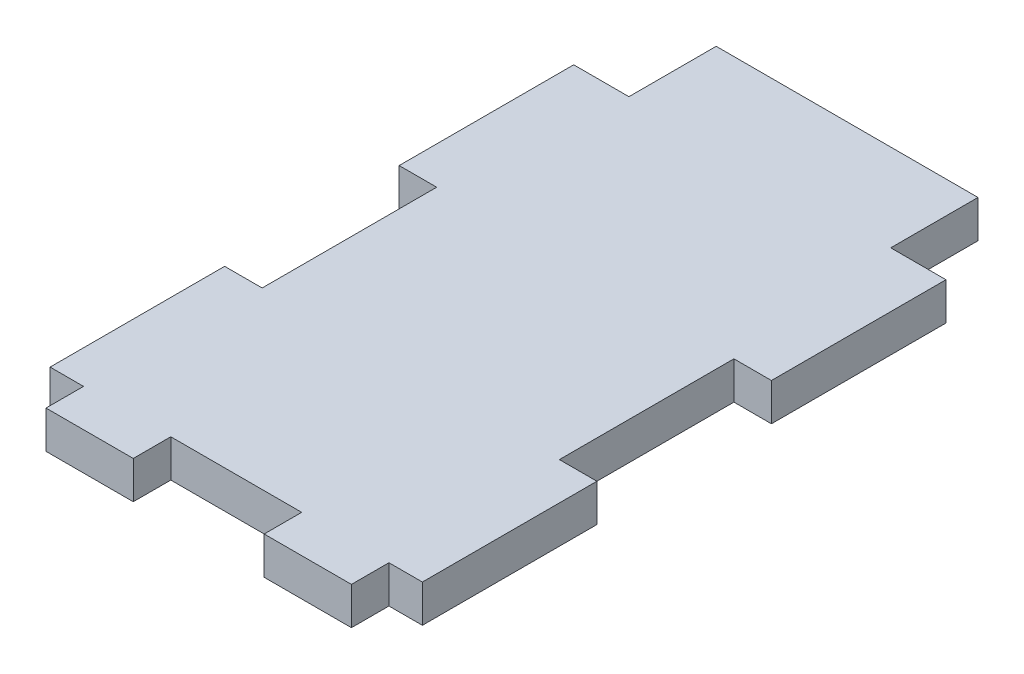
ISO-10303-21;
HEADER;
FILE_DESCRIPTION(('STEP AP214'),'2;1');
FILE_NAME('part.step','',(''),(''),'','','');
FILE_SCHEMA(('AUTOMOTIVE_DESIGN { 1 0 10303 214 1 1 1 1 }'));
ENDSEC;
DATA;
#1=APPLICATION_CONTEXT('core data for automotive mechanical design processes');
#2=APPLICATION_PROTOCOL_DEFINITION('international standard','automotive_design',2000,#1);
#3=PRODUCT_CONTEXT('',#1,'mechanical');
#4=PRODUCT('Part','Part','',(#3));
#5=PRODUCT_RELATED_PRODUCT_CATEGORY('part','',(#4));
#6=PRODUCT_DEFINITION_FORMATION('','',#4);
#7=PRODUCT_DEFINITION_CONTEXT('part definition',#1,'design');
#8=PRODUCT_DEFINITION('design','',#6,#7);
#9=PRODUCT_DEFINITION_SHAPE('','',#8);
#10=(LENGTH_UNIT() NAMED_UNIT(*) SI_UNIT(.MILLI.,.METRE.));
#11=(NAMED_UNIT(*) PLANE_ANGLE_UNIT() SI_UNIT($,.RADIAN.));
#12=(NAMED_UNIT(*) SI_UNIT($,.STERADIAN.) SOLID_ANGLE_UNIT());
#13=UNCERTAINTY_MEASURE_WITH_UNIT(LENGTH_MEASURE(1.E-05),#10,'distance_accuracy_value','');
#14=(GEOMETRIC_REPRESENTATION_CONTEXT(3) GLOBAL_UNCERTAINTY_ASSIGNED_CONTEXT((#13)) GLOBAL_UNIT_ASSIGNED_CONTEXT((#10,
#11,#12)) REPRESENTATION_CONTEXT('',''));
#15=CARTESIAN_POINT('',(0.,0.,0.));
#16=DIRECTION('',(0.,0.,1.));
#17=DIRECTION('',(1.,0.,0.));
#18=AXIS2_PLACEMENT_3D('',#15,#16,#17);
#19=CARTESIAN_POINT('',(27.0891,5.461,-38.1));
#20=DIRECTION('',(-1.,0.,0.));
#21=DIRECTION('',(0.,0.,1.));
#22=AXIS2_PLACEMENT_3D('',#19,#20,#21);
#23=PLANE('',#22);
#24=DIRECTION('',(0.,0.,-1.));
#25=VECTOR('',#24,1.);
#26=CARTESIAN_POINT('',(27.0891,0.,-38.1));
#27=LINE('',#26,#25);
#28=CARTESIAN_POINT('',(27.0891,0.,38.1));
#29=VERTEX_POINT('',#28);
#30=CARTESIAN_POINT('',(27.0891,0.,12.7));
#31=VERTEX_POINT('',#30);
#32=EDGE_CURVE('E373',#29,#31,#27,.T.);
#33=ORIENTED_EDGE('',*,*,#32,.T.);
#34=DIRECTION('',(0.,1.,0.));
#35=VECTOR('',#34,1.);
#36=CARTESIAN_POINT('',(27.0891,0.,12.7));
#37=LINE('',#36,#35);
#38=CARTESIAN_POINT('',(27.0891,5.461,12.7));
#39=VERTEX_POINT('',#38);
#40=EDGE_CURVE('E255',#31,#39,#37,.T.);
#41=ORIENTED_EDGE('',*,*,#40,.T.);
#42=DIRECTION('',(0.,0.,-1.));
#43=VECTOR('',#42,1.);
#44=CARTESIAN_POINT('',(27.0891,5.461,-38.1));
#45=LINE('',#44,#43);
#46=CARTESIAN_POINT('',(27.0891,5.461,38.1));
#47=VERTEX_POINT('',#46);
#48=EDGE_CURVE('E362',#47,#39,#45,.T.);
#49=ORIENTED_EDGE('',*,*,#48,.F.);
#50=DIRECTION('',(0.,-1.,0.));
#51=VECTOR('',#50,1.);
#52=CARTESIAN_POINT('',(27.0891,5.461,38.1));
#53=LINE('',#52,#51);
#54=EDGE_CURVE('E229',#47,#29,#53,.T.);
#55=ORIENTED_EDGE('',*,*,#54,.T.);
#56=EDGE_LOOP('',(#33,#41,#49,#55));
#57=FACE_BOUND('',#56,.T.);
#58=ADVANCED_FACE('F33',(#57),#23,.F.);
#59=CARTESIAN_POINT('',(-27.0891,5.461,-38.1));
#60=DIRECTION('',(1.,0.,0.));
#61=DIRECTION('',(0.,0.,-1.));
#62=AXIS2_PLACEMENT_3D('',#59,#60,#61);
#63=PLANE('',#62);
#64=DIRECTION('',(0.,0.,1.));
#65=VECTOR('',#64,1.);
#66=CARTESIAN_POINT('',(-27.0891,0.,-38.1));
#67=LINE('',#66,#65);
#68=CARTESIAN_POINT('',(-27.0891,0.,-38.1));
#69=VERTEX_POINT('',#68);
#70=CARTESIAN_POINT('',(-27.0891,0.,-12.7));
#71=VERTEX_POINT('',#70);
#72=EDGE_CURVE('E217',#69,#71,#67,.T.);
#73=ORIENTED_EDGE('',*,*,#72,.T.);
#74=DIRECTION('',(0.,1.,0.));
#75=VECTOR('',#74,1.);
#76=CARTESIAN_POINT('',(-27.0891,0.,-12.7));
#77=LINE('',#76,#75);
#78=CARTESIAN_POINT('',(-27.0891,5.461,-12.7));
#79=VERTEX_POINT('',#78);
#80=EDGE_CURVE('E259',#71,#79,#77,.T.);
#81=ORIENTED_EDGE('',*,*,#80,.T.);
#82=DIRECTION('',(0.,0.,1.));
#83=VECTOR('',#82,1.);
#84=CARTESIAN_POINT('',(-27.0891,5.461,-38.1));
#85=LINE('',#84,#83);
#86=CARTESIAN_POINT('',(-27.0891,5.461,-38.1));
#87=VERTEX_POINT('',#86);
#88=EDGE_CURVE('E242',#87,#79,#85,.T.);
#89=ORIENTED_EDGE('',*,*,#88,.F.);
#90=DIRECTION('',(0.,-1.,0.));
#91=VECTOR('',#90,1.);
#92=CARTESIAN_POINT('',(-27.0891,5.461,-38.1));
#93=LINE('',#92,#91);
#94=EDGE_CURVE('E41',#87,#69,#93,.T.);
#95=ORIENTED_EDGE('',*,*,#94,.T.);
#96=EDGE_LOOP('',(#73,#81,#89,#95));
#97=FACE_BOUND('',#96,.T.);
#98=ADVANCED_FACE('F239',(#97),#63,.F.);
#99=CARTESIAN_POINT('',(-27.0891,5.461,-38.1));
#100=DIRECTION('',(0.,0.,1.));
#101=DIRECTION('',(1.,0.,0.));
#102=AXIS2_PLACEMENT_3D('',#99,#100,#101);
#103=PLANE('',#102);
#104=DIRECTION('',(0.,1.,0.));
#105=VECTOR('',#104,1.);
#106=CARTESIAN_POINT('',(-19.05,-40.1609262841384,-38.1));
#107=LINE('',#106,#105);
#108=CARTESIAN_POINT('',(-19.05,0.,-38.1));
#109=VERTEX_POINT('',#108);
#110=CARTESIAN_POINT('',(-19.05,5.461,-38.1));
#111=VERTEX_POINT('',#110);
#112=EDGE_CURVE('E305',#109,#111,#107,.T.);
#113=ORIENTED_EDGE('',*,*,#112,.F.);
#114=DIRECTION('',(-1.,0.,0.));
#115=VECTOR('',#114,1.);
#116=CARTESIAN_POINT('',(-27.0891,0.,-38.1));
#117=LINE('',#116,#115);
#118=EDGE_CURVE('E222',#109,#69,#117,.T.);
#119=ORIENTED_EDGE('',*,*,#118,.T.);
#120=ORIENTED_EDGE('',*,*,#94,.F.);
#121=DIRECTION('',(-1.,0.,0.));
#122=VECTOR('',#121,1.);
#123=CARTESIAN_POINT('',(-27.0891,5.461,-38.1));
#124=LINE('',#123,#122);
#125=EDGE_CURVE('E365',#111,#87,#124,.T.);
#126=ORIENTED_EDGE('',*,*,#125,.F.);
#127=EDGE_LOOP('',(#113,#119,#120,#126));
#128=FACE_BOUND('',#127,.T.);
#129=ADVANCED_FACE('F404',(#128),#103,.F.);
#130=CARTESIAN_POINT('',(-27.0891,5.461,38.1));
#131=DIRECTION('',(0.,0.,-1.));
#132=DIRECTION('',(-1.,0.,0.));
#133=AXIS2_PLACEMENT_3D('',#130,#131,#132);
#134=PLANE('',#133);
#135=DIRECTION('',(1.,0.,0.));
#136=VECTOR('',#135,1.);
#137=CARTESIAN_POINT('',(-27.0891,0.,38.1));
#138=LINE('',#137,#136);
#139=CARTESIAN_POINT('',(-9.52500000000001,0.,38.1));
#140=VERTEX_POINT('',#139);
#141=CARTESIAN_POINT('',(9.52499999999999,0.,38.1));
#142=VERTEX_POINT('',#141);
#143=EDGE_CURVE('E228',#140,#142,#138,.T.);
#144=ORIENTED_EDGE('',*,*,#143,.T.);
#145=DIRECTION('',(0.,1.,0.));
#146=VECTOR('',#145,1.);
#147=CARTESIAN_POINT('',(9.525,-40.1609262841384,38.1));
#148=LINE('',#147,#146);
#149=CARTESIAN_POINT('',(9.52499999999999,5.461,38.1));
#150=VERTEX_POINT('',#149);
#151=EDGE_CURVE('E316',#142,#150,#148,.T.);
#152=ORIENTED_EDGE('',*,*,#151,.T.);
#153=DIRECTION('',(1.,0.,0.));
#154=VECTOR('',#153,1.);
#155=CARTESIAN_POINT('',(-27.0891,5.461,38.1));
#156=LINE('',#155,#154);
#157=CARTESIAN_POINT('',(-9.525,5.461,38.1));
#158=VERTEX_POINT('',#157);
#159=EDGE_CURVE('E372',#158,#150,#156,.T.);
#160=ORIENTED_EDGE('',*,*,#159,.F.);
#161=DIRECTION('',(0.,1.,0.));
#162=VECTOR('',#161,1.);
#163=CARTESIAN_POINT('',(-9.525,-40.1609262841384,38.1));
#164=LINE('',#163,#162);
#165=EDGE_CURVE('E354',#140,#158,#164,.T.);
#166=ORIENTED_EDGE('',*,*,#165,.F.);
#167=EDGE_LOOP('',(#144,#152,#160,#166));
#168=FACE_BOUND('',#167,.T.);
#169=ADVANCED_FACE('F406',(#168),#134,.F.);
#170=CARTESIAN_POINT('',(22.225,5.461,38.1));
#171=VERTEX_POINT('',#170);
#172=EDGE_CURVE('E370',#171,#47,#156,.T.);
#173=ORIENTED_EDGE('',*,*,#172,.F.);
#174=DIRECTION('',(0.,1.,0.));
#175=VECTOR('',#174,1.);
#176=CARTESIAN_POINT('',(22.225,-40.1609262841384,38.1));
#177=LINE('',#176,#175);
#178=CARTESIAN_POINT('',(22.225,0.,38.1));
#179=VERTEX_POINT('',#178);
#180=EDGE_CURVE('E330',#179,#171,#177,.T.);
#181=ORIENTED_EDGE('',*,*,#180,.F.);
#182=EDGE_CURVE('E221',#179,#29,#138,.T.);
#183=ORIENTED_EDGE('',*,*,#182,.T.);
#184=ORIENTED_EDGE('',*,*,#54,.F.);
#185=EDGE_LOOP('',(#173,#181,#183,#184));
#186=FACE_BOUND('',#185,.T.);
#187=ADVANCED_FACE('F410',(#186),#134,.F.);
#188=CARTESIAN_POINT('',(27.0891,5.461,-12.7));
#189=VERTEX_POINT('',#188);
#190=CARTESIAN_POINT('',(27.0891,5.461,-38.1));
#191=VERTEX_POINT('',#190);
#192=EDGE_CURVE('E227',#189,#191,#45,.T.);
#193=ORIENTED_EDGE('',*,*,#192,.F.);
#194=DIRECTION('',(0.,1.,0.));
#195=VECTOR('',#194,1.);
#196=CARTESIAN_POINT('',(27.0891,0.,-12.7));
#197=LINE('',#196,#195);
#198=CARTESIAN_POINT('',(27.0891,0.,-12.7));
#199=VERTEX_POINT('',#198);
#200=EDGE_CURVE('E273',#199,#189,#197,.T.);
#201=ORIENTED_EDGE('',*,*,#200,.F.);
#202=CARTESIAN_POINT('',(27.0891,0.,-38.1));
#203=VERTEX_POINT('',#202);
#204=EDGE_CURVE('E361',#199,#203,#27,.T.);
#205=ORIENTED_EDGE('',*,*,#204,.T.);
#206=DIRECTION('',(0.,-1.,0.));
#207=VECTOR('',#206,1.);
#208=CARTESIAN_POINT('',(27.0891,5.461,-38.1));
#209=LINE('',#208,#207);
#210=EDGE_CURVE('E11',#191,#203,#209,.T.);
#211=ORIENTED_EDGE('',*,*,#210,.F.);
#212=EDGE_LOOP('',(#193,#201,#205,#211));
#213=FACE_BOUND('',#212,.T.);
#214=ADVANCED_FACE('F35',(#213),#23,.F.);
#215=CARTESIAN_POINT('',(19.05,0.,-38.1));
#216=VERTEX_POINT('',#215);
#217=EDGE_CURVE('E218',#203,#216,#117,.T.);
#218=ORIENTED_EDGE('',*,*,#217,.T.);
#219=DIRECTION('',(0.,1.,0.));
#220=VECTOR('',#219,1.);
#221=CARTESIAN_POINT('',(19.05,-40.1609262841384,-38.1));
#222=LINE('',#221,#220);
#223=CARTESIAN_POINT('',(19.05,5.461,-38.1));
#224=VERTEX_POINT('',#223);
#225=EDGE_CURVE('E309',#216,#224,#222,.T.);
#226=ORIENTED_EDGE('',*,*,#225,.T.);
#227=EDGE_CURVE('E366',#191,#224,#124,.T.);
#228=ORIENTED_EDGE('',*,*,#227,.F.);
#229=ORIENTED_EDGE('',*,*,#210,.T.);
#230=EDGE_LOOP('',(#218,#226,#228,#229));
#231=FACE_BOUND('',#230,.T.);
#232=ADVANCED_FACE('F387',(#231),#103,.F.);
#233=CARTESIAN_POINT('',(-27.0891,5.461,12.7));
#234=VERTEX_POINT('',#233);
#235=CARTESIAN_POINT('',(-27.0891,5.461,38.1));
#236=VERTEX_POINT('',#235);
#237=EDGE_CURVE('E210',#234,#236,#85,.T.);
#238=ORIENTED_EDGE('',*,*,#237,.F.);
#239=DIRECTION('',(0.,1.,0.));
#240=VECTOR('',#239,1.);
#241=CARTESIAN_POINT('',(-27.0891,0.,12.7));
#242=LINE('',#241,#240);
#243=CARTESIAN_POINT('',(-27.0891,0.,12.7));
#244=VERTEX_POINT('',#243);
#245=EDGE_CURVE('E197',#244,#234,#242,.T.);
#246=ORIENTED_EDGE('',*,*,#245,.F.);
#247=CARTESIAN_POINT('',(-27.0891,0.,38.1));
#248=VERTEX_POINT('',#247);
#249=EDGE_CURVE('E208',#244,#248,#67,.T.);
#250=ORIENTED_EDGE('',*,*,#249,.T.);
#251=DIRECTION('',(0.,-1.,0.));
#252=VECTOR('',#251,1.);
#253=CARTESIAN_POINT('',(-27.0891,5.461,38.1));
#254=LINE('',#253,#252);
#255=EDGE_CURVE('E232',#236,#248,#254,.T.);
#256=ORIENTED_EDGE('',*,*,#255,.F.);
#257=EDGE_LOOP('',(#238,#246,#250,#256));
#258=FACE_BOUND('',#257,.T.);
#259=ADVANCED_FACE('F206',(#258),#63,.F.);
#260=CARTESIAN_POINT('',(-22.225,0.,38.1));
#261=VERTEX_POINT('',#260);
#262=EDGE_CURVE('E216',#248,#261,#138,.T.);
#263=ORIENTED_EDGE('',*,*,#262,.T.);
#264=DIRECTION('',(0.,1.,0.));
#265=VECTOR('',#264,1.);
#266=CARTESIAN_POINT('',(-22.225,-40.1609262841384,38.1));
#267=LINE('',#266,#265);
#268=CARTESIAN_POINT('',(-22.225,5.461,38.1));
#269=VERTEX_POINT('',#268);
#270=EDGE_CURVE('E341',#261,#269,#267,.T.);
#271=ORIENTED_EDGE('',*,*,#270,.T.);
#272=EDGE_CURVE('E233',#236,#269,#156,.T.);
#273=ORIENTED_EDGE('',*,*,#272,.F.);
#274=ORIENTED_EDGE('',*,*,#255,.T.);
#275=EDGE_LOOP('',(#263,#271,#273,#274));
#276=FACE_BOUND('',#275,.T.);
#277=ADVANCED_FACE('F413',(#276),#134,.F.);
#278=CARTESIAN_POINT('',(0.,5.461,0.));
#279=DIRECTION('',(0.,1.,0.));
#280=DIRECTION('',(0.,0.,1.));
#281=AXIS2_PLACEMENT_3D('',#278,#279,#280);
#282=PLANE('',#281);
#283=DIRECTION('',(-1.,0.,0.));
#284=VECTOR('',#283,1.);
#285=CARTESIAN_POINT('',(-27.0891,5.461,-12.7));
#286=LINE('',#285,#284);
#287=CARTESIAN_POINT('',(-21.6281,5.461,-12.7));
#288=VERTEX_POINT('',#287);
#289=EDGE_CURVE('E202',#288,#79,#286,.T.);
#290=ORIENTED_EDGE('',*,*,#289,.F.);
#291=DIRECTION('',(0.,0.,-1.));
#292=VECTOR('',#291,1.);
#293=CARTESIAN_POINT('',(-21.6281,5.461,-12.7));
#294=LINE('',#293,#292);
#295=CARTESIAN_POINT('',(-21.6281,5.461,12.7));
#296=VERTEX_POINT('',#295);
#297=EDGE_CURVE('E254',#296,#288,#294,.T.);
#298=ORIENTED_EDGE('',*,*,#297,.F.);
#299=DIRECTION('',(1.,0.,0.));
#300=VECTOR('',#299,1.);
#301=CARTESIAN_POINT('',(-27.0891,5.461,12.7));
#302=LINE('',#301,#300);
#303=EDGE_CURVE('E252',#234,#296,#302,.T.);
#304=ORIENTED_EDGE('',*,*,#303,.F.);
#305=ORIENTED_EDGE('',*,*,#237,.T.);
#306=ORIENTED_EDGE('',*,*,#272,.T.);
#307=DIRECTION('',(0.,0.,1.));
#308=VECTOR('',#307,1.);
#309=CARTESIAN_POINT('',(-22.225,5.461,38.1));
#310=LINE('',#309,#308);
#311=CARTESIAN_POINT('',(-22.225,5.461,43.561));
#312=VERTEX_POINT('',#311);
#313=EDGE_CURVE('E337',#269,#312,#310,.T.);
#314=ORIENTED_EDGE('',*,*,#313,.T.);
#315=DIRECTION('',(1.,0.,0.));
#316=VECTOR('',#315,1.);
#317=CARTESIAN_POINT('',(-22.225,5.461,43.561));
#318=LINE('',#317,#316);
#319=CARTESIAN_POINT('',(-9.525,5.461,43.561));
#320=VERTEX_POINT('',#319);
#321=EDGE_CURVE('E346',#312,#320,#318,.T.);
#322=ORIENTED_EDGE('',*,*,#321,.T.);
#323=DIRECTION('',(0.,0.,-1.));
#324=VECTOR('',#323,1.);
#325=CARTESIAN_POINT('',(-9.525,5.461,38.1));
#326=LINE('',#325,#324);
#327=EDGE_CURVE('E349',#320,#158,#326,.T.);
#328=ORIENTED_EDGE('',*,*,#327,.T.);
#329=ORIENTED_EDGE('',*,*,#159,.T.);
#330=DIRECTION('',(0.,0.,1.));
#331=VECTOR('',#330,1.);
#332=CARTESIAN_POINT('',(9.525,5.461,38.1));
#333=LINE('',#332,#331);
#334=CARTESIAN_POINT('',(9.525,5.461,43.561));
#335=VERTEX_POINT('',#334);
#336=EDGE_CURVE('E296',#150,#335,#333,.T.);
#337=ORIENTED_EDGE('',*,*,#336,.T.);
#338=DIRECTION('',(1.,0.,0.));
#339=VECTOR('',#338,1.);
#340=CARTESIAN_POINT('',(9.525,5.461,43.561));
#341=LINE('',#340,#339);
#342=CARTESIAN_POINT('',(22.225,5.461,43.561));
#343=VERTEX_POINT('',#342);
#344=EDGE_CURVE('E322',#335,#343,#341,.T.);
#345=ORIENTED_EDGE('',*,*,#344,.T.);
#346=DIRECTION('',(0.,0.,-1.));
#347=VECTOR('',#346,1.);
#348=CARTESIAN_POINT('',(22.225,5.461,38.1));
#349=LINE('',#348,#347);
#350=EDGE_CURVE('E325',#343,#171,#349,.T.);
#351=ORIENTED_EDGE('',*,*,#350,.T.);
#352=ORIENTED_EDGE('',*,*,#172,.T.);
#353=ORIENTED_EDGE('',*,*,#48,.T.);
#354=DIRECTION('',(1.,0.,0.));
#355=VECTOR('',#354,1.);
#356=CARTESIAN_POINT('',(27.0891,5.461,12.7));
#357=LINE('',#356,#355);
#358=CARTESIAN_POINT('',(21.6281,5.461,12.7));
#359=VERTEX_POINT('',#358);
#360=EDGE_CURVE('E268',#359,#39,#357,.T.);
#361=ORIENTED_EDGE('',*,*,#360,.F.);
#362=DIRECTION('',(0.,0.,1.));
#363=VECTOR('',#362,1.);
#364=CARTESIAN_POINT('',(21.6281,5.461,-12.7));
#365=LINE('',#364,#363);
#366=CARTESIAN_POINT('',(21.6281,5.461,-12.7));
#367=VERTEX_POINT('',#366);
#368=EDGE_CURVE('E277',#367,#359,#365,.T.);
#369=ORIENTED_EDGE('',*,*,#368,.F.);
#370=DIRECTION('',(-1.,0.,0.));
#371=VECTOR('',#370,1.);
#372=CARTESIAN_POINT('',(27.0891,5.461,-12.7));
#373=LINE('',#372,#371);
#374=EDGE_CURVE('E274',#189,#367,#373,.T.);
#375=ORIENTED_EDGE('',*,*,#374,.F.);
#376=ORIENTED_EDGE('',*,*,#192,.T.);
#377=ORIENTED_EDGE('',*,*,#227,.T.);
#378=DIRECTION('',(0.,0.,-1.));
#379=VECTOR('',#378,1.);
#380=CARTESIAN_POINT('',(19.05,5.461,-38.1));
#381=LINE('',#380,#379);
#382=CARTESIAN_POINT('',(19.05,5.461,-50.8));
#383=VERTEX_POINT('',#382);
#384=EDGE_CURVE('E299',#224,#383,#381,.T.);
#385=ORIENTED_EDGE('',*,*,#384,.T.);
#386=DIRECTION('',(-1.,0.,0.));
#387=VECTOR('',#386,1.);
#388=CARTESIAN_POINT('',(-19.05,5.461,-50.8));
#389=LINE('',#388,#387);
#390=CARTESIAN_POINT('',(-19.05,5.461,-50.8));
#391=VERTEX_POINT('',#390);
#392=EDGE_CURVE('E302',#383,#391,#389,.T.);
#393=ORIENTED_EDGE('',*,*,#392,.T.);
#394=DIRECTION('',(0.,0.,1.));
#395=VECTOR('',#394,1.);
#396=CARTESIAN_POINT('',(-19.05,5.461,-38.1));
#397=LINE('',#396,#395);
#398=EDGE_CURVE('E261',#391,#111,#397,.T.);
#399=ORIENTED_EDGE('',*,*,#398,.T.);
#400=ORIENTED_EDGE('',*,*,#125,.T.);
#401=ORIENTED_EDGE('',*,*,#88,.T.);
#402=EDGE_LOOP('',(#290,#298,#304,#305,#306,#314,#322,#328,#329,#337,#345,#351,#352,#353,#361,
#369,#375,#376,#377,#385,#393,#399,#400,#401));
#403=FACE_BOUND('',#402,.T.);
#404=ADVANCED_FACE('F391',(#403),#282,.T.);
#405=CARTESIAN_POINT('',(0.,0.,0.));
#406=DIRECTION('',(0.,1.,0.));
#407=DIRECTION('',(0.,0.,1.));
#408=AXIS2_PLACEMENT_3D('',#405,#406,#407);
#409=PLANE('',#408);
#410=DIRECTION('',(0.,0.,-1.));
#411=VECTOR('',#410,1.);
#412=CARTESIAN_POINT('',(-21.6281,0.,-12.7));
#413=LINE('',#412,#411);
#414=CARTESIAN_POINT('',(-21.6281,0.,12.7));
#415=VERTEX_POINT('',#414);
#416=CARTESIAN_POINT('',(-21.6281,0.,-12.7));
#417=VERTEX_POINT('',#416);
#418=EDGE_CURVE('E48',#415,#417,#413,.T.);
#419=ORIENTED_EDGE('',*,*,#418,.T.);
#420=DIRECTION('',(-1.,0.,0.));
#421=VECTOR('',#420,1.);
#422=CARTESIAN_POINT('',(-27.0891,0.,-12.7));
#423=LINE('',#422,#421);
#424=EDGE_CURVE('E211',#417,#71,#423,.T.);
#425=ORIENTED_EDGE('',*,*,#424,.T.);
#426=ORIENTED_EDGE('',*,*,#72,.F.);
#427=ORIENTED_EDGE('',*,*,#118,.F.);
#428=DIRECTION('',(0.,0.,-1.));
#429=VECTOR('',#428,1.);
#430=CARTESIAN_POINT('',(-19.05,0.,-38.1));
#431=LINE('',#430,#429);
#432=CARTESIAN_POINT('',(-19.05,0.,-50.8));
#433=VERTEX_POINT('',#432);
#434=EDGE_CURVE('E294',#109,#433,#431,.T.);
#435=ORIENTED_EDGE('',*,*,#434,.T.);
#436=DIRECTION('',(1.,0.,0.));
#437=VECTOR('',#436,1.);
#438=CARTESIAN_POINT('',(-19.05,0.,-50.8));
#439=LINE('',#438,#437);
#440=CARTESIAN_POINT('',(19.05,0.,-50.8));
#441=VERTEX_POINT('',#440);
#442=EDGE_CURVE('E291',#433,#441,#439,.T.);
#443=ORIENTED_EDGE('',*,*,#442,.T.);
#444=DIRECTION('',(0.,0.,1.));
#445=VECTOR('',#444,1.);
#446=CARTESIAN_POINT('',(19.05,0.,-38.1));
#447=LINE('',#446,#445);
#448=EDGE_CURVE('E288',#441,#216,#447,.T.);
#449=ORIENTED_EDGE('',*,*,#448,.T.);
#450=ORIENTED_EDGE('',*,*,#217,.F.);
#451=ORIENTED_EDGE('',*,*,#204,.F.);
#452=DIRECTION('',(-1.,0.,0.));
#453=VECTOR('',#452,1.);
#454=CARTESIAN_POINT('',(27.0891,0.,-12.7));
#455=LINE('',#454,#453);
#456=CARTESIAN_POINT('',(21.6281,0.,-12.7));
#457=VERTEX_POINT('',#456);
#458=EDGE_CURVE('E265',#199,#457,#455,.T.);
#459=ORIENTED_EDGE('',*,*,#458,.T.);
#460=DIRECTION('',(0.,0.,1.));
#461=VECTOR('',#460,1.);
#462=CARTESIAN_POINT('',(21.6281,0.,-12.7));
#463=LINE('',#462,#461);
#464=CARTESIAN_POINT('',(21.6281,0.,12.7));
#465=VERTEX_POINT('',#464);
#466=EDGE_CURVE('E56',#457,#465,#463,.T.);
#467=ORIENTED_EDGE('',*,*,#466,.T.);
#468=DIRECTION('',(1.,0.,0.));
#469=VECTOR('',#468,1.);
#470=CARTESIAN_POINT('',(27.0891,0.,12.7));
#471=LINE('',#470,#469);
#472=EDGE_CURVE('E270',#465,#31,#471,.T.);
#473=ORIENTED_EDGE('',*,*,#472,.T.);
#474=ORIENTED_EDGE('',*,*,#32,.F.);
#475=ORIENTED_EDGE('',*,*,#182,.F.);
#476=DIRECTION('',(0.,0.,1.));
#477=VECTOR('',#476,1.);
#478=CARTESIAN_POINT('',(22.225,0.,38.1));
#479=LINE('',#478,#477);
#480=CARTESIAN_POINT('',(22.225,0.,43.561));
#481=VERTEX_POINT('',#480);
#482=EDGE_CURVE('E313',#179,#481,#479,.T.);
#483=ORIENTED_EDGE('',*,*,#482,.T.);
#484=DIRECTION('',(-1.,0.,0.));
#485=VECTOR('',#484,1.);
#486=CARTESIAN_POINT('',(9.525,0.,43.561));
#487=LINE('',#486,#485);
#488=CARTESIAN_POINT('',(9.525,0.,43.561));
#489=VERTEX_POINT('',#488);
#490=EDGE_CURVE('E319',#481,#489,#487,.T.);
#491=ORIENTED_EDGE('',*,*,#490,.T.);
#492=DIRECTION('',(0.,0.,-1.));
#493=VECTOR('',#492,1.);
#494=CARTESIAN_POINT('',(9.525,0.,38.1));
#495=LINE('',#494,#493);
#496=EDGE_CURVE('E315',#489,#142,#495,.T.);
#497=ORIENTED_EDGE('',*,*,#496,.T.);
#498=ORIENTED_EDGE('',*,*,#143,.F.);
#499=DIRECTION('',(0.,0.,1.));
#500=VECTOR('',#499,1.);
#501=CARTESIAN_POINT('',(-9.525,0.,38.1));
#502=LINE('',#501,#500);
#503=CARTESIAN_POINT('',(-9.525,0.,43.561));
#504=VERTEX_POINT('',#503);
#505=EDGE_CURVE('E338',#140,#504,#502,.T.);
#506=ORIENTED_EDGE('',*,*,#505,.T.);
#507=DIRECTION('',(-1.,0.,0.));
#508=VECTOR('',#507,1.);
#509=CARTESIAN_POINT('',(-22.225,0.,43.561));
#510=LINE('',#509,#508);
#511=CARTESIAN_POINT('',(-22.225,0.,43.561));
#512=VERTEX_POINT('',#511);
#513=EDGE_CURVE('E343',#504,#512,#510,.T.);
#514=ORIENTED_EDGE('',*,*,#513,.T.);
#515=DIRECTION('',(0.,0.,-1.));
#516=VECTOR('',#515,1.);
#517=CARTESIAN_POINT('',(-22.225,0.,38.1));
#518=LINE('',#517,#516);
#519=EDGE_CURVE('E340',#512,#261,#518,.T.);
#520=ORIENTED_EDGE('',*,*,#519,.T.);
#521=ORIENTED_EDGE('',*,*,#262,.F.);
#522=ORIENTED_EDGE('',*,*,#249,.F.);
#523=DIRECTION('',(1.,0.,0.));
#524=VECTOR('',#523,1.);
#525=CARTESIAN_POINT('',(-27.0891,0.,12.7));
#526=LINE('',#525,#524);
#527=EDGE_CURVE('E193',#244,#415,#526,.T.);
#528=ORIENTED_EDGE('',*,*,#527,.T.);
#529=EDGE_LOOP('',(#419,#425,#426,#427,#435,#443,#449,#450,#451,#459,#467,#473,#474,#475,#483,
#491,#497,#498,#506,#514,#520,#521,#522,#528));
#530=FACE_BOUND('',#529,.T.);
#531=ADVANCED_FACE('F214',(#530),#409,.F.);
#532=CARTESIAN_POINT('',(-22.225,-40.1609262841384,38.1));
#533=DIRECTION('',(-1.,0.,0.));
#534=DIRECTION('',(0.,0.,1.));
#535=AXIS2_PLACEMENT_3D('',#532,#533,#534);
#536=PLANE('',#535);
#537=ORIENTED_EDGE('',*,*,#519,.F.);
#538=DIRECTION('',(0.,1.,0.));
#539=VECTOR('',#538,1.);
#540=CARTESIAN_POINT('',(-22.225,-40.1609262841384,43.561));
#541=LINE('',#540,#539);
#542=EDGE_CURVE('E352',#512,#312,#541,.T.);
#543=ORIENTED_EDGE('',*,*,#542,.T.);
#544=ORIENTED_EDGE('',*,*,#313,.F.);
#545=ORIENTED_EDGE('',*,*,#270,.F.);
#546=EDGE_LOOP('',(#537,#543,#544,#545));
#547=FACE_BOUND('',#546,.T.);
#548=ADVANCED_FACE('F445',(#547),#536,.T.);
#549=CARTESIAN_POINT('',(-9.525,-40.1609262841384,38.1));
#550=DIRECTION('',(1.,0.,0.));
#551=DIRECTION('',(0.,0.,-1.));
#552=AXIS2_PLACEMENT_3D('',#549,#550,#551);
#553=PLANE('',#552);
#554=ORIENTED_EDGE('',*,*,#505,.F.);
#555=ORIENTED_EDGE('',*,*,#165,.T.);
#556=ORIENTED_EDGE('',*,*,#327,.F.);
#557=DIRECTION('',(0.,1.,0.));
#558=VECTOR('',#557,1.);
#559=CARTESIAN_POINT('',(-9.525,-40.1609262841384,43.561));
#560=LINE('',#559,#558);
#561=EDGE_CURVE('E357',#504,#320,#560,.T.);
#562=ORIENTED_EDGE('',*,*,#561,.F.);
#563=EDGE_LOOP('',(#554,#555,#556,#562));
#564=FACE_BOUND('',#563,.T.);
#565=ADVANCED_FACE('F489',(#564),#553,.T.);
#566=CARTESIAN_POINT('',(-22.225,-40.1609262841384,43.561));
#567=DIRECTION('',(0.,0.,1.));
#568=DIRECTION('',(1.,0.,0.));
#569=AXIS2_PLACEMENT_3D('',#566,#567,#568);
#570=PLANE('',#569);
#571=ORIENTED_EDGE('',*,*,#513,.F.);
#572=ORIENTED_EDGE('',*,*,#561,.T.);
#573=ORIENTED_EDGE('',*,*,#321,.F.);
#574=ORIENTED_EDGE('',*,*,#542,.F.);
#575=EDGE_LOOP('',(#571,#572,#573,#574));
#576=FACE_BOUND('',#575,.T.);
#577=ADVANCED_FACE('F487',(#576),#570,.T.);
#578=CARTESIAN_POINT('',(9.525,-40.1609262841384,38.1));
#579=DIRECTION('',(-1.,0.,0.));
#580=DIRECTION('',(0.,0.,1.));
#581=AXIS2_PLACEMENT_3D('',#578,#579,#580);
#582=PLANE('',#581);
#583=ORIENTED_EDGE('',*,*,#496,.F.);
#584=DIRECTION('',(0.,1.,0.));
#585=VECTOR('',#584,1.);
#586=CARTESIAN_POINT('',(9.525,-40.1609262841384,43.561));
#587=LINE('',#586,#585);
#588=EDGE_CURVE('E328',#489,#335,#587,.T.);
#589=ORIENTED_EDGE('',*,*,#588,.T.);
#590=ORIENTED_EDGE('',*,*,#336,.F.);
#591=ORIENTED_EDGE('',*,*,#151,.F.);
#592=EDGE_LOOP('',(#583,#589,#590,#591));
#593=FACE_BOUND('',#592,.T.);
#594=ADVANCED_FACE('F480',(#593),#582,.T.);
#595=CARTESIAN_POINT('',(22.225,-40.1609262841384,38.1));
#596=DIRECTION('',(1.,0.,0.));
#597=DIRECTION('',(0.,0.,-1.));
#598=AXIS2_PLACEMENT_3D('',#595,#596,#597);
#599=PLANE('',#598);
#600=ORIENTED_EDGE('',*,*,#482,.F.);
#601=ORIENTED_EDGE('',*,*,#180,.T.);
#602=ORIENTED_EDGE('',*,*,#350,.F.);
#603=DIRECTION('',(0.,1.,0.));
#604=VECTOR('',#603,1.);
#605=CARTESIAN_POINT('',(22.225,-40.1609262841384,43.561));
#606=LINE('',#605,#604);
#607=EDGE_CURVE('E333',#481,#343,#606,.T.);
#608=ORIENTED_EDGE('',*,*,#607,.F.);
#609=EDGE_LOOP('',(#600,#601,#602,#608));
#610=FACE_BOUND('',#609,.T.);
#611=ADVANCED_FACE('F477',(#610),#599,.T.);
#612=CARTESIAN_POINT('',(9.525,-40.1609262841384,43.561));
#613=DIRECTION('',(0.,0.,1.));
#614=DIRECTION('',(1.,0.,0.));
#615=AXIS2_PLACEMENT_3D('',#612,#613,#614);
#616=PLANE('',#615);
#617=ORIENTED_EDGE('',*,*,#490,.F.);
#618=ORIENTED_EDGE('',*,*,#607,.T.);
#619=ORIENTED_EDGE('',*,*,#344,.F.);
#620=ORIENTED_EDGE('',*,*,#588,.F.);
#621=EDGE_LOOP('',(#617,#618,#619,#620));
#622=FACE_BOUND('',#621,.T.);
#623=ADVANCED_FACE('F476',(#622),#616,.T.);
#624=CARTESIAN_POINT('',(-19.05,-40.1609262841384,-38.1));
#625=DIRECTION('',(-1.,0.,0.));
#626=DIRECTION('',(0.,0.,1.));
#627=AXIS2_PLACEMENT_3D('',#624,#625,#626);
#628=PLANE('',#627);
#629=ORIENTED_EDGE('',*,*,#434,.F.);
#630=ORIENTED_EDGE('',*,*,#112,.T.);
#631=ORIENTED_EDGE('',*,*,#398,.F.);
#632=DIRECTION('',(0.,1.,0.));
#633=VECTOR('',#632,1.);
#634=CARTESIAN_POINT('',(-19.05,-40.1609262841384,-50.8));
#635=LINE('',#634,#633);
#636=EDGE_CURVE('E292',#433,#391,#635,.T.);
#637=ORIENTED_EDGE('',*,*,#636,.F.);
#638=EDGE_LOOP('',(#629,#630,#631,#637));
#639=FACE_BOUND('',#638,.T.);
#640=ADVANCED_FACE('F403',(#639),#628,.T.);
#641=CARTESIAN_POINT('',(-19.05,-40.1609262841384,-50.8));
#642=DIRECTION('',(0.,0.,-1.));
#643=DIRECTION('',(-1.,0.,0.));
#644=AXIS2_PLACEMENT_3D('',#641,#642,#643);
#645=PLANE('',#644);
#646=ORIENTED_EDGE('',*,*,#442,.F.);
#647=ORIENTED_EDGE('',*,*,#636,.T.);
#648=ORIENTED_EDGE('',*,*,#392,.F.);
#649=DIRECTION('',(0.,1.,0.));
#650=VECTOR('',#649,1.);
#651=CARTESIAN_POINT('',(19.05,-40.1609262841384,-50.8));
#652=LINE('',#651,#650);
#653=EDGE_CURVE('E307',#441,#383,#652,.T.);
#654=ORIENTED_EDGE('',*,*,#653,.F.);
#655=EDGE_LOOP('',(#646,#647,#648,#654));
#656=FACE_BOUND('',#655,.T.);
#657=ADVANCED_FACE('F399',(#656),#645,.T.);
#658=CARTESIAN_POINT('',(19.05,-40.1609262841384,-38.1));
#659=DIRECTION('',(1.,0.,0.));
#660=DIRECTION('',(0.,0.,-1.));
#661=AXIS2_PLACEMENT_3D('',#658,#659,#660);
#662=PLANE('',#661);
#663=ORIENTED_EDGE('',*,*,#448,.F.);
#664=ORIENTED_EDGE('',*,*,#653,.T.);
#665=ORIENTED_EDGE('',*,*,#384,.F.);
#666=ORIENTED_EDGE('',*,*,#225,.F.);
#667=EDGE_LOOP('',(#663,#664,#665,#666));
#668=FACE_BOUND('',#667,.T.);
#669=ADVANCED_FACE('F395',(#668),#662,.T.);
#670=CARTESIAN_POINT('',(27.0891,0.,12.7));
#671=DIRECTION('',(0.,0.,1.));
#672=DIRECTION('',(1.,0.,0.));
#673=AXIS2_PLACEMENT_3D('',#670,#671,#672);
#674=PLANE('',#673);
#675=ORIENTED_EDGE('',*,*,#360,.T.);
#676=ORIENTED_EDGE('',*,*,#40,.F.);
#677=ORIENTED_EDGE('',*,*,#472,.F.);
#678=DIRECTION('',(0.,1.,0.));
#679=VECTOR('',#678,1.);
#680=CARTESIAN_POINT('',(21.6281,0.,12.7));
#681=LINE('',#680,#679);
#682=EDGE_CURVE('E283',#465,#359,#681,.T.);
#683=ORIENTED_EDGE('',*,*,#682,.T.);
#684=EDGE_LOOP('',(#675,#676,#677,#683));
#685=FACE_BOUND('',#684,.T.);
#686=ADVANCED_FACE('F464',(#685),#674,.F.);
#687=CARTESIAN_POINT('',(21.6281,0.,-12.7));
#688=DIRECTION('',(-1.,0.,0.));
#689=DIRECTION('',(0.,0.,1.));
#690=AXIS2_PLACEMENT_3D('',#687,#688,#689);
#691=PLANE('',#690);
#692=ORIENTED_EDGE('',*,*,#368,.T.);
#693=ORIENTED_EDGE('',*,*,#682,.F.);
#694=ORIENTED_EDGE('',*,*,#466,.F.);
#695=DIRECTION('',(0.,1.,0.));
#696=VECTOR('',#695,1.);
#697=CARTESIAN_POINT('',(21.6281,0.,-12.7));
#698=LINE('',#697,#696);
#699=EDGE_CURVE('E285',#457,#367,#698,.T.);
#700=ORIENTED_EDGE('',*,*,#699,.T.);
#701=EDGE_LOOP('',(#692,#693,#694,#700));
#702=FACE_BOUND('',#701,.T.);
#703=ADVANCED_FACE('F458',(#702),#691,.F.);
#704=CARTESIAN_POINT('',(27.0891,0.,-12.7));
#705=DIRECTION('',(0.,0.,-1.));
#706=DIRECTION('',(-1.,0.,0.));
#707=AXIS2_PLACEMENT_3D('',#704,#705,#706);
#708=PLANE('',#707);
#709=ORIENTED_EDGE('',*,*,#374,.T.);
#710=ORIENTED_EDGE('',*,*,#699,.F.);
#711=ORIENTED_EDGE('',*,*,#458,.F.);
#712=ORIENTED_EDGE('',*,*,#200,.T.);
#713=EDGE_LOOP('',(#709,#710,#711,#712));
#714=FACE_BOUND('',#713,.T.);
#715=ADVANCED_FACE('F451',(#714),#708,.F.);
#716=CARTESIAN_POINT('',(-27.0891,0.,-12.7));
#717=DIRECTION('',(0.,0.,-1.));
#718=DIRECTION('',(-1.,0.,0.));
#719=AXIS2_PLACEMENT_3D('',#716,#717,#718);
#720=PLANE('',#719);
#721=ORIENTED_EDGE('',*,*,#289,.T.);
#722=ORIENTED_EDGE('',*,*,#80,.F.);
#723=ORIENTED_EDGE('',*,*,#424,.F.);
#724=DIRECTION('',(0.,1.,0.));
#725=VECTOR('',#724,1.);
#726=CARTESIAN_POINT('',(-21.6281,0.,-12.7));
#727=LINE('',#726,#725);
#728=EDGE_CURVE('E262',#417,#288,#727,.T.);
#729=ORIENTED_EDGE('',*,*,#728,.T.);
#730=EDGE_LOOP('',(#721,#722,#723,#729));
#731=FACE_BOUND('',#730,.T.);
#732=ADVANCED_FACE('F449',(#731),#720,.F.);
#733=CARTESIAN_POINT('',(-21.6281,0.,-12.7));
#734=DIRECTION('',(1.,0.,0.));
#735=DIRECTION('',(0.,0.,-1.));
#736=AXIS2_PLACEMENT_3D('',#733,#734,#735);
#737=PLANE('',#736);
#738=ORIENTED_EDGE('',*,*,#297,.T.);
#739=ORIENTED_EDGE('',*,*,#728,.F.);
#740=ORIENTED_EDGE('',*,*,#418,.F.);
#741=DIRECTION('',(0.,1.,0.));
#742=VECTOR('',#741,1.);
#743=CARTESIAN_POINT('',(-21.6281,0.,12.7));
#744=LINE('',#743,#742);
#745=EDGE_CURVE('E199',#415,#296,#744,.T.);
#746=ORIENTED_EDGE('',*,*,#745,.T.);
#747=EDGE_LOOP('',(#738,#739,#740,#746));
#748=FACE_BOUND('',#747,.T.);
#749=ADVANCED_FACE('F448',(#748),#737,.F.);
#750=CARTESIAN_POINT('',(-27.0891,0.,12.7));
#751=DIRECTION('',(0.,0.,1.));
#752=DIRECTION('',(1.,0.,0.));
#753=AXIS2_PLACEMENT_3D('',#750,#751,#752);
#754=PLANE('',#753);
#755=ORIENTED_EDGE('',*,*,#303,.T.);
#756=ORIENTED_EDGE('',*,*,#745,.F.);
#757=ORIENTED_EDGE('',*,*,#527,.F.);
#758=ORIENTED_EDGE('',*,*,#245,.T.);
#759=EDGE_LOOP('',(#755,#756,#757,#758));
#760=FACE_BOUND('',#759,.T.);
#761=ADVANCED_FACE('F196',(#760),#754,.F.);
#762=CLOSED_SHELL('',(#58,#98,#129,#169,#187,#214,#232,#259,#277,#404,#531,#548,#565,#577,#594,
#611,#623,#640,#657,#669,#686,#703,#715,#732,#749,#761));
#763=MANIFOLD_SOLID_BREP('B2',#762);
#764=ADVANCED_BREP_SHAPE_REPRESENTATION('',(#18,#763),#14);
#765=SHAPE_DEFINITION_REPRESENTATION(#9,#764);
ENDSEC;
END-ISO-10303-21;
